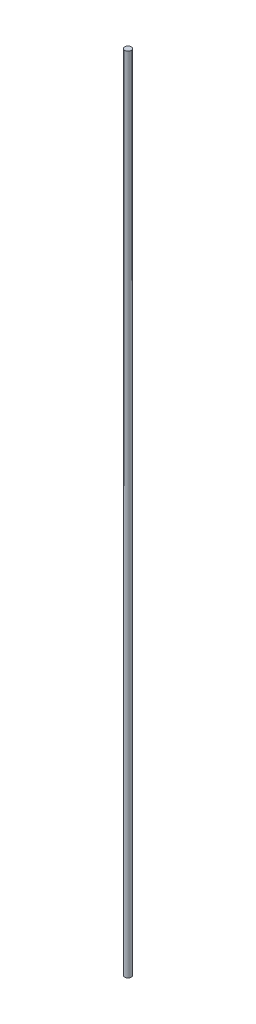
ISO-10303-21;
HEADER;
FILE_DESCRIPTION(('STEP AP214'),'2;1');
FILE_NAME('part.step','',(''),(''),'','','');
FILE_SCHEMA(('AUTOMOTIVE_DESIGN { 1 0 10303 214 1 1 1 1 }'));
ENDSEC;
DATA;
#1=APPLICATION_CONTEXT('core data for automotive mechanical design processes');
#2=APPLICATION_PROTOCOL_DEFINITION('international standard','automotive_design',2000,#1);
#3=PRODUCT_CONTEXT('',#1,'mechanical');
#4=PRODUCT('Part','Part','',(#3));
#5=PRODUCT_RELATED_PRODUCT_CATEGORY('part','',(#4));
#6=PRODUCT_DEFINITION_FORMATION('','',#4);
#7=PRODUCT_DEFINITION_CONTEXT('part definition',#1,'design');
#8=PRODUCT_DEFINITION('design','',#6,#7);
#9=PRODUCT_DEFINITION_SHAPE('','',#8);
#10=(LENGTH_UNIT() NAMED_UNIT(*) SI_UNIT(.MILLI.,.METRE.));
#11=(NAMED_UNIT(*) PLANE_ANGLE_UNIT() SI_UNIT($,.RADIAN.));
#12=(NAMED_UNIT(*) SI_UNIT($,.STERADIAN.) SOLID_ANGLE_UNIT());
#13=UNCERTAINTY_MEASURE_WITH_UNIT(LENGTH_MEASURE(1.E-05),#10,'distance_accuracy_value','');
#14=(GEOMETRIC_REPRESENTATION_CONTEXT(3) GLOBAL_UNCERTAINTY_ASSIGNED_CONTEXT((#13)) GLOBAL_UNIT_ASSIGNED_CONTEXT((#10,
#11,#12)) REPRESENTATION_CONTEXT('',''));
#15=CARTESIAN_POINT('',(0.,0.,0.));
#16=DIRECTION('',(0.,0.,1.));
#17=DIRECTION('',(1.,0.,0.));
#18=AXIS2_PLACEMENT_3D('',#15,#16,#17);
#19=CARTESIAN_POINT('',(0.,1000.,0.));
#20=DIRECTION('',(0.,-1.,0.));
#21=DIRECTION('',(0.,0.,-1.));
#22=AXIS2_PLACEMENT_3D('',#19,#20,#21);
#23=CYLINDRICAL_SURFACE('',#22,4.);
#24=CARTESIAN_POINT('',(0.,1000.,0.));
#25=DIRECTION('',(0.,1.,0.));
#26=DIRECTION('',(0.,0.,1.));
#27=AXIS2_PLACEMENT_3D('',#24,#25,#26);
#28=CIRCLE('',#27,4.);
#29=CARTESIAN_POINT('',(0.,1000.,4.));
#30=VERTEX_POINT('',#29);
#31=EDGE_CURVE('E10',#30,#30,#28,.T.);
#32=ORIENTED_EDGE('',*,*,#31,.F.);
#33=EDGE_LOOP('',(#32));
#34=FACE_BOUND('',#33,.T.);
#35=CARTESIAN_POINT('',(0.,0.,0.));
#36=DIRECTION('',(0.,1.,0.));
#37=DIRECTION('',(0.,0.,1.));
#38=AXIS2_PLACEMENT_3D('',#35,#36,#37);
#39=CIRCLE('',#38,4.);
#40=CARTESIAN_POINT('',(0.,0.,4.));
#41=VERTEX_POINT('',#40);
#42=EDGE_CURVE('E35',#41,#41,#39,.T.);
#43=ORIENTED_EDGE('',*,*,#42,.T.);
#44=EDGE_LOOP('',(#43));
#45=FACE_BOUND('',#44,.T.);
#46=ADVANCED_FACE('F32',(#34,#45),#23,.T.);
#47=CARTESIAN_POINT('',(0.,1000.,0.));
#48=DIRECTION('',(0.,1.,0.));
#49=DIRECTION('',(0.,0.,1.));
#50=AXIS2_PLACEMENT_3D('',#47,#48,#49);
#51=PLANE('',#50);
#52=ORIENTED_EDGE('',*,*,#31,.T.);
#53=EDGE_LOOP('',(#52));
#54=FACE_BOUND('',#53,.T.);
#55=ADVANCED_FACE('F47',(#54),#51,.T.);
#56=CARTESIAN_POINT('',(0.,0.,0.));
#57=DIRECTION('',(0.,1.,0.));
#58=DIRECTION('',(0.,0.,1.));
#59=AXIS2_PLACEMENT_3D('',#56,#57,#58);
#60=PLANE('',#59);
#61=ORIENTED_EDGE('',*,*,#42,.F.);
#62=EDGE_LOOP('',(#61));
#63=FACE_BOUND('',#62,.T.);
#64=ADVANCED_FACE('F45',(#63),#60,.F.);
#65=CLOSED_SHELL('',(#46,#55,#64));
#66=MANIFOLD_SOLID_BREP('B2',#65);
#67=ADVANCED_BREP_SHAPE_REPRESENTATION('',(#18,#66),#14);
#68=SHAPE_DEFINITION_REPRESENTATION(#9,#67);
ENDSEC;
END-ISO-10303-21;
